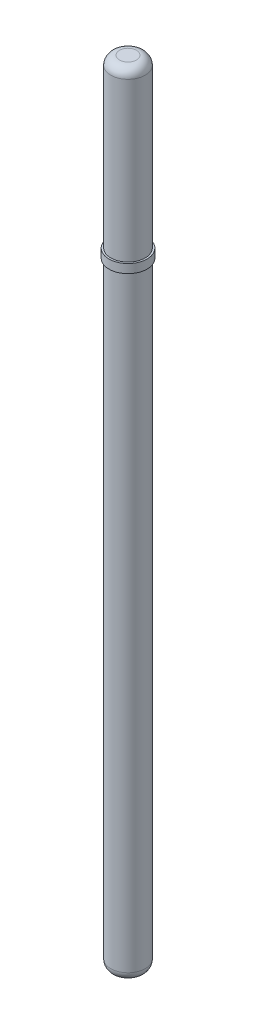
ISO-10303-21;
HEADER;
FILE_DESCRIPTION(('STEP AP214'),'2;1');
FILE_NAME('part.step','',(''),(''),'','','');
FILE_SCHEMA(('AUTOMOTIVE_DESIGN { 1 0 10303 214 1 1 1 1 }'));
ENDSEC;
DATA;
#1=APPLICATION_CONTEXT('core data for automotive mechanical design processes');
#2=APPLICATION_PROTOCOL_DEFINITION('international standard','automotive_design',2000,#1);
#3=PRODUCT_CONTEXT('',#1,'mechanical');
#4=PRODUCT('Part','Part','',(#3));
#5=PRODUCT_RELATED_PRODUCT_CATEGORY('part','',(#4));
#6=PRODUCT_DEFINITION_FORMATION('','',#4);
#7=PRODUCT_DEFINITION_CONTEXT('part definition',#1,'design');
#8=PRODUCT_DEFINITION('design','',#6,#7);
#9=PRODUCT_DEFINITION_SHAPE('','',#8);
#10=(LENGTH_UNIT() NAMED_UNIT(*) SI_UNIT(.MILLI.,.METRE.));
#11=(NAMED_UNIT(*) PLANE_ANGLE_UNIT() SI_UNIT($,.RADIAN.));
#12=(NAMED_UNIT(*) SI_UNIT($,.STERADIAN.) SOLID_ANGLE_UNIT());
#13=UNCERTAINTY_MEASURE_WITH_UNIT(LENGTH_MEASURE(1.E-05),#10,'distance_accuracy_value','');
#14=(GEOMETRIC_REPRESENTATION_CONTEXT(3) GLOBAL_UNCERTAINTY_ASSIGNED_CONTEXT((#13)) GLOBAL_UNIT_ASSIGNED_CONTEXT((#10,
#11,#12)) REPRESENTATION_CONTEXT('',''));
#15=CARTESIAN_POINT('',(0.,0.,0.));
#16=DIRECTION('',(0.,0.,1.));
#17=DIRECTION('',(1.,0.,0.));
#18=AXIS2_PLACEMENT_3D('',#15,#16,#17);
#19=CARTESIAN_POINT('',(0.,45.,0.));
#20=DIRECTION('',(0.,-1.,0.));
#21=DIRECTION('',(0.,0.,-1.));
#22=AXIS2_PLACEMENT_3D('',#19,#20,#21);
#23=CYLINDRICAL_SURFACE('',#22,0.98);
#24=CARTESIAN_POINT('',(0.,0.499999999999987,0.));
#25=DIRECTION('',(0.,1.,0.));
#26=DIRECTION('',(0.,0.,1.));
#27=AXIS2_PLACEMENT_3D('',#24,#25,#26);
#28=CIRCLE('',#27,0.98);
#29=CARTESIAN_POINT('',(0.,0.499999999999987,0.98));
#30=VERTEX_POINT('',#29);
#31=EDGE_CURVE('E60',#30,#30,#28,.T.);
#32=ORIENTED_EDGE('',*,*,#31,.T.);
#33=EDGE_LOOP('',(#32));
#34=FACE_BOUND('',#33,.T.);
#35=CARTESIAN_POINT('',(0.,35.,0.));
#36=DIRECTION('',(0.,1.,0.));
#37=DIRECTION('',(0.,0.,1.));
#38=AXIS2_PLACEMENT_3D('',#35,#36,#37);
#39=CIRCLE('',#38,0.98);
#40=CARTESIAN_POINT('',(0.,35.,0.98));
#41=VERTEX_POINT('',#40);
#42=EDGE_CURVE('E11',#41,#41,#39,.T.);
#43=ORIENTED_EDGE('',*,*,#42,.F.);
#44=EDGE_LOOP('',(#43));
#45=FACE_BOUND('',#44,.T.);
#46=ADVANCED_FACE('F45',(#34,#45),#23,.T.);
#47=CARTESIAN_POINT('',(0.,0.,0.));
#48=DIRECTION('',(0.,1.,0.));
#49=DIRECTION('',(0.,0.,1.));
#50=AXIS2_PLACEMENT_3D('',#47,#48,#49);
#51=PLANE('',#50);
#52=CARTESIAN_POINT('',(0.,0.,0.));
#53=DIRECTION('',(0.,1.,0.));
#54=DIRECTION('',(0.,0.,1.));
#55=AXIS2_PLACEMENT_3D('',#52,#53,#54);
#56=CIRCLE('',#55,0.48);
#57=CARTESIAN_POINT('',(0.,0.,0.48));
#58=VERTEX_POINT('',#57);
#59=EDGE_CURVE('E56',#58,#58,#56,.F.);
#60=ORIENTED_EDGE('',*,*,#59,.T.);
#61=EDGE_LOOP('',(#60));
#62=FACE_BOUND('',#61,.T.);
#63=ADVANCED_FACE('F99',(#62),#51,.F.);
#64=CARTESIAN_POINT('',(0.,0.5,0.));
#65=DIRECTION('',(0.,1.,0.));
#66=DIRECTION('',(0.,0.,1.));
#67=AXIS2_PLACEMENT_3D('',#64,#65,#66);
#68=DEGENERATE_TOROIDAL_SURFACE('',#67,0.48,0.5,.T.);
#69=ORIENTED_EDGE('',*,*,#59,.F.);
#70=EDGE_LOOP('',(#69));
#71=FACE_BOUND('',#70,.T.);
#72=ORIENTED_EDGE('',*,*,#31,.F.);
#73=EDGE_LOOP('',(#72));
#74=FACE_BOUND('',#73,.T.);
#75=ADVANCED_FACE('F91',(#71,#74),#68,.T.);
#76=CARTESIAN_POINT('',(0.,35.,0.));
#77=DIRECTION('',(0.,1.,0.));
#78=DIRECTION('',(0.,0.,1.));
#79=AXIS2_PLACEMENT_3D('',#76,#77,#78);
#80=CYLINDRICAL_SURFACE('',#79,1.08);
#81=CARTESIAN_POINT('',(0.,35.,0.));
#82=DIRECTION('',(0.,1.,0.));
#83=DIRECTION('',(1.,0.,0.));
#84=AXIS2_PLACEMENT_3D('',#81,#82,#83);
#85=CIRCLE('',#84,1.08);
#86=CARTESIAN_POINT('',(1.08,35.,0.));
#87=VERTEX_POINT('',#86);
#88=EDGE_CURVE('E68',#87,#87,#85,.T.);
#89=ORIENTED_EDGE('',*,*,#88,.T.);
#90=EDGE_LOOP('',(#89));
#91=FACE_BOUND('',#90,.T.);
#92=CARTESIAN_POINT('',(0.,35.5,0.));
#93=DIRECTION('',(0.,1.,0.));
#94=DIRECTION('',(1.,0.,0.));
#95=AXIS2_PLACEMENT_3D('',#92,#93,#94);
#96=CIRCLE('',#95,1.08);
#97=CARTESIAN_POINT('',(1.08,35.5,0.));
#98=VERTEX_POINT('',#97);
#99=EDGE_CURVE('E69',#98,#98,#96,.T.);
#100=ORIENTED_EDGE('',*,*,#99,.F.);
#101=EDGE_LOOP('',(#100));
#102=FACE_BOUND('',#101,.T.);
#103=ADVANCED_FACE('F89',(#91,#102),#80,.T.);
#104=CARTESIAN_POINT('',(0.,35.,0.));
#105=DIRECTION('',(0.,1.,0.));
#106=DIRECTION('',(0.,0.,1.));
#107=AXIS2_PLACEMENT_3D('',#104,#105,#106);
#108=PLANE('',#107);
#109=ORIENTED_EDGE('',*,*,#42,.T.);
#110=EDGE_LOOP('',(#109));
#111=FACE_BOUND('',#110,.T.);
#112=ORIENTED_EDGE('',*,*,#88,.F.);
#113=EDGE_LOOP('',(#112));
#114=FACE_BOUND('',#113,.T.);
#115=ADVANCED_FACE('F85',(#111,#114),#108,.F.);
#116=CARTESIAN_POINT('',(0.,35.5,0.));
#117=DIRECTION('',(0.,1.,0.));
#118=DIRECTION('',(0.,0.,1.));
#119=AXIS2_PLACEMENT_3D('',#116,#117,#118);
#120=PLANE('',#119);
#121=CARTESIAN_POINT('',(0.,35.5,0.));
#122=DIRECTION('',(0.,1.,0.));
#123=DIRECTION('',(0.,0.,1.));
#124=AXIS2_PLACEMENT_3D('',#121,#122,#123);
#125=CIRCLE('',#124,0.98);
#126=CARTESIAN_POINT('',(0.,35.5,0.98));
#127=VERTEX_POINT('',#126);
#128=EDGE_CURVE('E72',#127,#127,#125,.T.);
#129=ORIENTED_EDGE('',*,*,#128,.F.);
#130=EDGE_LOOP('',(#129));
#131=FACE_BOUND('',#130,.T.);
#132=ORIENTED_EDGE('',*,*,#99,.T.);
#133=EDGE_LOOP('',(#132));
#134=FACE_BOUND('',#133,.T.);
#135=ADVANCED_FACE('F81',(#131,#134),#120,.T.);
#136=CARTESIAN_POINT('',(0.,45.,0.));
#137=DIRECTION('',(0.,1.,0.));
#138=DIRECTION('',(0.,0.,1.));
#139=AXIS2_PLACEMENT_3D('',#136,#137,#138);
#140=PLANE('',#139);
#141=CARTESIAN_POINT('',(0.,45.,0.));
#142=DIRECTION('',(0.,1.,0.));
#143=DIRECTION('',(0.,0.,1.));
#144=AXIS2_PLACEMENT_3D('',#141,#142,#143);
#145=CIRCLE('',#144,0.48);
#146=CARTESIAN_POINT('',(0.,45.,0.48));
#147=VERTEX_POINT('',#146);
#148=EDGE_CURVE('E52',#147,#147,#145,.T.);
#149=ORIENTED_EDGE('',*,*,#148,.T.);
#150=EDGE_LOOP('',(#149));
#151=FACE_BOUND('',#150,.T.);
#152=ADVANCED_FACE('F84',(#151),#140,.T.);
#153=CARTESIAN_POINT('',(0.,44.5,0.));
#154=DIRECTION('',(0.,1.,0.));
#155=DIRECTION('',(0.,0.,1.));
#156=AXIS2_PLACEMENT_3D('',#153,#154,#155);
#157=DEGENERATE_TOROIDAL_SURFACE('',#156,0.48,0.5,.T.);
#158=CARTESIAN_POINT('',(0.,44.5,0.));
#159=DIRECTION('',(0.,1.,0.));
#160=DIRECTION('',(0.,0.,1.));
#161=AXIS2_PLACEMENT_3D('',#158,#159,#160);
#162=CIRCLE('',#161,0.98);
#163=CARTESIAN_POINT('',(0.,44.5,0.98));
#164=VERTEX_POINT('',#163);
#165=EDGE_CURVE('E65',#164,#164,#162,.F.);
#166=ORIENTED_EDGE('',*,*,#165,.F.);
#167=EDGE_LOOP('',(#166));
#168=FACE_BOUND('',#167,.T.);
#169=ORIENTED_EDGE('',*,*,#148,.F.);
#170=EDGE_LOOP('',(#169));
#171=FACE_BOUND('',#170,.T.);
#172=ADVANCED_FACE('F47',(#168,#171),#157,.T.);
#173=ORIENTED_EDGE('',*,*,#128,.T.);
#174=EDGE_LOOP('',(#173));
#175=FACE_BOUND('',#174,.T.);
#176=ORIENTED_EDGE('',*,*,#165,.T.);
#177=EDGE_LOOP('',(#176));
#178=FACE_BOUND('',#177,.T.);
#179=ADVANCED_FACE('F78',(#175,#178),#23,.T.);
#180=CLOSED_SHELL('',(#46,#63,#75,#103,#115,#135,#152,#172,#179));
#181=MANIFOLD_SOLID_BREP('B2',#180);
#182=ADVANCED_BREP_SHAPE_REPRESENTATION('',(#18,#181),#14);
#183=SHAPE_DEFINITION_REPRESENTATION(#9,#182);
ENDSEC;
END-ISO-10303-21;
